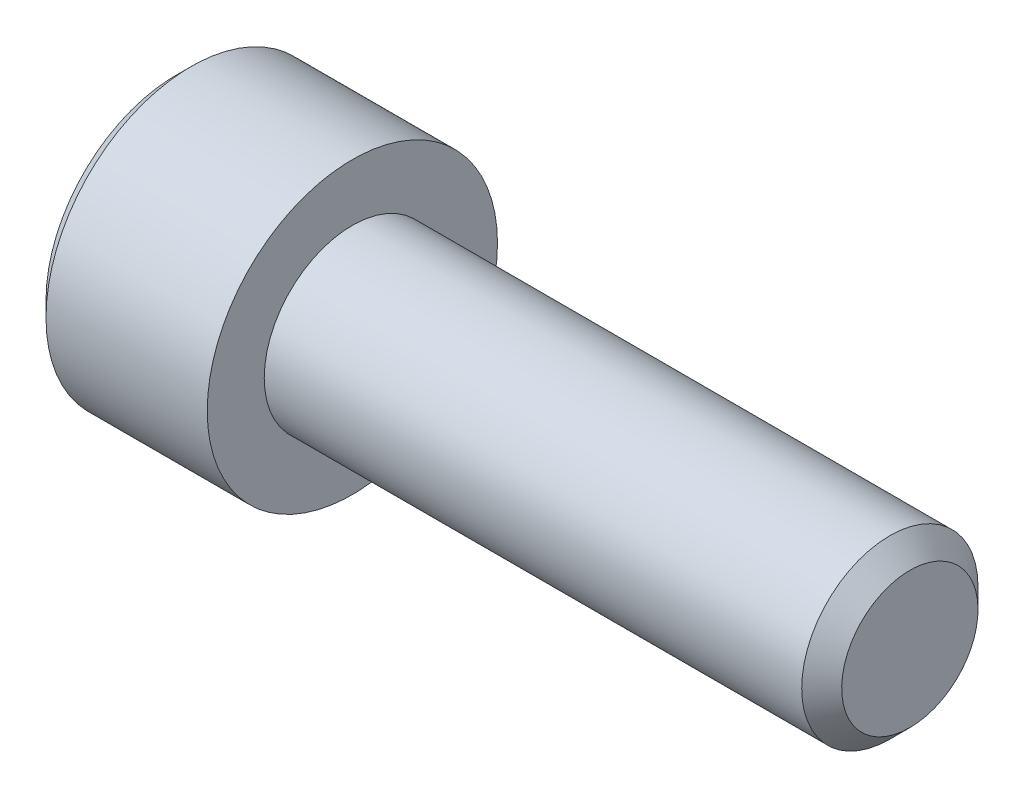
ISO-10303-21;
HEADER;
FILE_DESCRIPTION(('STEP AP214'),'2;1');
FILE_NAME('part.step','',(''),(''),'','','');
FILE_SCHEMA(('AUTOMOTIVE_DESIGN { 1 0 10303 214 1 1 1 1 }'));
ENDSEC;
DATA;
#1=APPLICATION_CONTEXT('core data for automotive mechanical design processes');
#2=APPLICATION_PROTOCOL_DEFINITION('international standard','automotive_design',2000,#1);
#3=PRODUCT_CONTEXT('',#1,'mechanical');
#4=PRODUCT('Part','Part','',(#3));
#5=PRODUCT_RELATED_PRODUCT_CATEGORY('part','',(#4));
#6=PRODUCT_DEFINITION_FORMATION('','',#4);
#7=PRODUCT_DEFINITION_CONTEXT('part definition',#1,'design');
#8=PRODUCT_DEFINITION('design','',#6,#7);
#9=PRODUCT_DEFINITION_SHAPE('','',#8);
#10=(LENGTH_UNIT() NAMED_UNIT(*) SI_UNIT(.MILLI.,.METRE.));
#11=(NAMED_UNIT(*) PLANE_ANGLE_UNIT() SI_UNIT($,.RADIAN.));
#12=(NAMED_UNIT(*) SI_UNIT($,.STERADIAN.) SOLID_ANGLE_UNIT());
#13=UNCERTAINTY_MEASURE_WITH_UNIT(LENGTH_MEASURE(1.E-05),#10,'distance_accuracy_value','');
#14=(GEOMETRIC_REPRESENTATION_CONTEXT(3) GLOBAL_UNCERTAINTY_ASSIGNED_CONTEXT((#13)) GLOBAL_UNIT_ASSIGNED_CONTEXT((#10,
#11,#12)) REPRESENTATION_CONTEXT('',''));
#15=CARTESIAN_POINT('',(0.,0.,0.));
#16=DIRECTION('',(0.,0.,1.));
#17=DIRECTION('',(1.,0.,0.));
#18=AXIS2_PLACEMENT_3D('',#15,#16,#17);
#19=CARTESIAN_POINT('',(-2.21694374982917,0.,0.));
#20=DIRECTION('',(-1.,0.,0.));
#21=DIRECTION('',(0.,0.,1.));
#22=AXIS2_PLACEMENT_3D('',#19,#20,#21);
#23=CONICAL_SURFACE('',#22,2.07459633060125,1.04719755102264);
#24=CARTESIAN_POINT('',(-1.01917499975457,0.,-2.27373675443232E-10));
#25=VERTEX_POINT('',#24);
#26=VERTEX_LOOP('',#25);
#27=FACE_BOUND('',#26,.T.);
#28=CARTESIAN_POINT('',(-2.2097999998902,1.09725896522129E-11,-2.06222299275537));
#29=CARTESIAN_POINT('',(-2.18363203744138,0.0784811371108861,-2.01691188712442));
#30=CARTESIAN_POINT('',(-2.15983364512322,0.157639722270298,-1.97120965667397));
#31=CARTESIAN_POINT('',(-2.11829426610016,0.317327470541627,-1.87901389222323));
#32=CARTESIAN_POINT('',(-2.10056797284901,0.397859470072181,-1.83251872061588));
#33=CARTESIAN_POINT('',(-2.07297571942376,0.557925476432116,-1.74010456875587));
#34=CARTESIAN_POINT('',(-2.06292609609855,0.637434861953671,-1.6941998036219));
#35=CARTESIAN_POINT('',(-2.05093118668194,0.796827555740842,-1.60217438895701));
#36=CARTESIAN_POINT('',(-2.04897596538542,0.876710285054878,-1.55605407368395));
#37=CARTESIAN_POINT('',(-2.05305388237055,1.02596259515888,-1.46988321226823));
#38=CARTESIAN_POINT('',(-2.05808575687008,1.09535457247395,-1.42981973548578));
#39=CARTESIAN_POINT('',(-2.07403062072086,1.23368646100672,-1.34995378240387));
#40=CARTESIAN_POINT('',(-2.0849490514755,1.30262589412846,-1.31015158213326));
#41=CARTESIAN_POINT('',(-2.11224301510014,1.44124275939744,-1.23012109765599));
#42=CARTESIAN_POINT('',(-2.12873419131745,1.51090265655993,-1.1899029372775));
#43=CARTESIAN_POINT('',(-2.1661621894439,1.64918377401521,-1.11006629689085));
#44=CARTESIAN_POINT('',(-2.18709022290799,1.71780676448237,-1.07044679487204));
#45=CARTESIAN_POINT('',(-2.20979999989728,1.78593750001027,-1.03111149637492));
#46=B_SPLINE_CURVE_WITH_KNOTS('',3,(#28,#29,#30,#31,#32,#33,#34,#35,#36,#37,#38,#39,#40,#41,#42,
#43,#44,#45),.UNSPECIFIED.,.F.,.F.,(4,2,2,2,2,2,2,2,4),(0.,0.283085391587975,0.566851041335249,
0.84359437023131,1.11999791881968,1.36062343407243,1.60147176059153,1.8476609488634,
2.09336697168605),.UNSPECIFIED.);
#47=CARTESIAN_POINT('',(-2.20979999988995,-4.62298986547413E-12,-2.0622229927381));
#48=VERTEX_POINT('',#47);
#49=CARTESIAN_POINT('',(-2.20979999989872,1.78593750000579,-1.03111149638766));
#50=VERTEX_POINT('',#49);
#51=EDGE_CURVE('E171',#48,#50,#46,.T.);
#52=ORIENTED_EDGE('',*,*,#51,.F.);
#53=CARTESIAN_POINT('',(-2.20979999990519,-1.78593750000782,-1.03111149636406));
#54=CARTESIAN_POINT('',(-2.18363203745135,-1.70745636291131,-1.0764226020009));
#55=CARTESIAN_POINT('',(-2.1598336451306,-1.62829777775272,-1.12212483245411));
#56=CARTESIAN_POINT('',(-2.11829426610459,-1.46861002948081,-1.21432059690755));
#57=CARTESIAN_POINT('',(-2.10056797285306,-1.38807802994883,-1.26081576851484));
#58=CARTESIAN_POINT('',(-2.07297571942659,-1.22801202358675,-1.35322992037548));
#59=CARTESIAN_POINT('',(-2.06292609610054,-1.14850263806446,-1.3991346855101));
#60=CARTESIAN_POINT('',(-2.05093118668254,-0.989109944275587,-1.49116010017613));
#61=CARTESIAN_POINT('',(-2.04897596538548,-0.909227214960583,-1.53728041544968));
#62=CARTESIAN_POINT('',(-2.05305388236971,-0.759974904856102,-1.62345127686564));
#63=CARTESIAN_POINT('',(-2.05808575686875,-0.690582927541512,-1.66351475364783));
#64=CARTESIAN_POINT('',(-2.07403062071851,-0.55225103900968,-1.74338070672921));
#65=CARTESIAN_POINT('',(-2.08494905147262,-0.483311605888391,-1.78318290699956));
#66=CARTESIAN_POINT('',(-2.11224301509619,-0.344694740620254,-1.86321339147634));
#67=CARTESIAN_POINT('',(-2.12873419131297,-0.275034843458156,-1.9034315518546));
#68=CARTESIAN_POINT('',(-2.16616218943838,-0.136753726003615,-1.98326819224082));
#69=CARTESIAN_POINT('',(-2.18709022290197,-0.0681307355368011,-2.02288769425943));
#70=CARTESIAN_POINT('',(-2.20979999989077,-9.24720308734519E-12,-2.06222299275635));
#71=B_SPLINE_CURVE_WITH_KNOTS('',3,(#53,#54,#55,#56,#57,#58,#59,#60,#61,#62,#63,#64,#65,#66,#67,
#68,#69,#70),.UNSPECIFIED.,.F.,.F.,(4,2,2,2,2,2,2,2,4),(0.,0.283085391591813,0.566851041342766,
0.843594370242013,1.11999791883364,1.36062343408466,1.60147176060198,1.84766094887221,
2.0933669716933),.UNSPECIFIED.);
#72=CARTESIAN_POINT('',(-2.20979999989676,-1.78593750000737,-1.03111149637815));
#73=VERTEX_POINT('',#72);
#74=EDGE_CURVE('E21',#73,#48,#71,.T.);
#75=ORIENTED_EDGE('',*,*,#74,.F.);
#76=CARTESIAN_POINT('',(-2.20979999990561,-1.78593749998911,1.03111149639684));
#77=CARTESIAN_POINT('',(-2.18363203745164,-1.78593749999609,0.94048928513493));
#78=CARTESIAN_POINT('',(-2.15983364513082,-1.78593749999895,0.849084824233336));
#79=CARTESIAN_POINT('',(-2.11829426610471,-1.78593750000105,0.664693295329928));
#80=CARTESIAN_POINT('',(-2.10056797285318,-1.78593750000028,0.571702952113989));
#81=CARTESIAN_POINT('',(-2.07297571942667,-1.78593749999973,0.386874648391726));
#82=CARTESIAN_POINT('',(-2.0629260961006,-1.78593749999993,0.295065118122805));
#83=CARTESIAN_POINT('',(-2.05093118668256,-1.78593750000007,0.111014288790957));
#84=CARTESIAN_POINT('',(-2.04897596538548,-1.78593750000002,0.0187736582437296));
#85=CARTESIAN_POINT('',(-2.05305388236974,-1.78593749999998,-0.153568064590571));
#86=CARTESIAN_POINT('',(-2.058085756869,-1.7859375,-0.233695018157239));
#87=CARTESIAN_POINT('',(-2.07403062071954,-1.7859375,-0.393426924324539));
#88=CARTESIAN_POINT('',(-2.08494905147419,-1.7859375,-0.473031324867516));
#89=CARTESIAN_POINT('',(-2.11224301509914,-1.7859375,-0.633092293825662));
#90=CARTESIAN_POINT('',(-2.12873419131676,-1.7859375,-0.713528614584499));
#91=CARTESIAN_POINT('',(-2.16616218944403,-1.7859375,-0.873201895361495));
#92=CARTESIAN_POINT('',(-2.18709022290864,-1.7859375,-0.952440899400956));
#93=CARTESIAN_POINT('',(-2.20979999989852,-1.7859375,-1.031111496397));
#94=B_SPLINE_CURVE_WITH_KNOTS('',3,(#76,#77,#78,#79,#80,#81,#82,#83,#84,#85,#86,#87,#88,#89,#90,
#91,#92,#93),.UNSPECIFIED.,.F.,.F.,(4,2,2,2,2,2,2,2,4),(0.,0.283085391591947,0.566851041343033,
0.843594370242341,1.11999791883402,1.36062343409196,1.60147176061623,1.84766094889376,
2.09336697172211),.UNSPECIFIED.);
#95=CARTESIAN_POINT('',(-2.2097999998989,-1.78593750000737,1.03111149638554));
#96=VERTEX_POINT('',#95);
#97=EDGE_CURVE('E95',#96,#73,#94,.T.);
#98=ORIENTED_EDGE('',*,*,#97,.F.);
#99=CARTESIAN_POINT('',(-2.20979999991607,3.12057355636284E-11,2.06222299275177));
#100=CARTESIAN_POINT('',(-2.1836320374565,-0.0784811370760846,2.01691188713447));
#101=CARTESIAN_POINT('',(-2.15983364513316,-0.157639722239571,1.97120965668901));
#102=CARTESIAN_POINT('',(-2.11829426610485,-0.317327470516074,1.87901389224068));
#103=CARTESIAN_POINT('',(-2.10056797285361,-0.397859470047716,1.83251872063072));
#104=CARTESIAN_POINT('',(-2.07297571942713,-0.557925476410414,1.7401045687677));
#105=CARTESIAN_POINT('',(-2.06292609610077,-0.637434861933618,1.69419980363329));
#106=CARTESIAN_POINT('',(-2.05093118668249,-0.796827555723997,1.60217438896692));
#107=CARTESIAN_POINT('',(-2.04897596538545,-0.876710285039592,1.55605407369282));
#108=CARTESIAN_POINT('',(-2.05305388236982,-1.0259625951465,1.46988321227534));
#109=CARTESIAN_POINT('',(-2.05808575686909,-1.0953545724629,1.42981973549214));
#110=CARTESIAN_POINT('',(-2.07403062071961,-1.2336864609983,1.34995378240874));
#111=CARTESIAN_POINT('',(-2.08494905147424,-1.30262589412133,1.31015158213737));
#112=CARTESIAN_POINT('',(-2.11224301509913,-1.44124275939309,1.2301210976585));
#113=CARTESIAN_POINT('',(-2.12873419131671,-1.51090265655705,1.18990293727916));
#114=CARTESIAN_POINT('',(-2.16616218944389,-1.64918377401529,1.11006629689081));
#115=CARTESIAN_POINT('',(-2.18709022290845,-1.71780676448393,1.07044679487115));
#116=CARTESIAN_POINT('',(-2.20979999989828,-1.78593750001328,1.03111149637318));
#117=B_SPLINE_CURVE_WITH_KNOTS('',3,(#99,#100,#101,#102,#103,#104,#105,#106,#107,#108,#109,#110,
#111,#112,#113,#114,#115,#116),.UNSPECIFIED.,.F.,.F.,(4,2,2,2,2,2,2,2,4),(0.,0.28308539159484,
0.566851041348576,0.843594370250035,1.11999791884397,1.36062343410124,1.60147176062477,
1.84766094890181,2.09336697172975),.UNSPECIFIED.);
#118=CARTESIAN_POINT('',(-2.20979999989529,1.13804215653077E-11,2.06222299274735));
#119=VERTEX_POINT('',#118);
#120=EDGE_CURVE('E137',#119,#96,#117,.T.);
#121=ORIENTED_EDGE('',*,*,#120,.F.);
#122=CARTESIAN_POINT('',(-2.2097999999056,1.7859375000084,1.03111149636342));
#123=CARTESIAN_POINT('',(-2.18363203745163,1.70745636291196,1.07642260200042));
#124=CARTESIAN_POINT('',(-2.15983364513081,1.62829777775339,1.12212483245369));
#125=CARTESIAN_POINT('',(-2.11829426610471,1.46861002948143,1.21432059690722));
#126=CARTESIAN_POINT('',(-2.10056797285317,1.38807802994941,1.26081576851452));
#127=CARTESIAN_POINT('',(-2.07297571942667,1.22801202358727,1.35322992037517));
#128=CARTESIAN_POINT('',(-2.06292609610059,1.14850263806497,1.3991346855098));
#129=CARTESIAN_POINT('',(-2.05093118668256,0.989109944276064,1.49116010017585));
#130=CARTESIAN_POINT('',(-2.04897596538548,0.909227214961045,1.53728041544942));
#131=CARTESIAN_POINT('',(-2.05305388236974,0.759974904854406,1.62345127686662));
#132=CARTESIAN_POINT('',(-2.05808575686902,0.69058292753768,1.66351475365005));
#133=CARTESIAN_POINT('',(-2.07403062071961,0.55225103900161,1.74338070673387));
#134=CARTESIAN_POINT('',(-2.08494905147431,0.48331160587822,1.78318290700543));
#135=CARTESIAN_POINT('',(-2.11224301509936,0.34469474060583,1.86321339148466));
#136=CARTESIAN_POINT('',(-2.12873419131703,0.275034843441581,1.90343155186417));
#137=CARTESIAN_POINT('',(-2.16616218944444,0.136753725982819,1.98326819225283));
#138=CARTESIAN_POINT('',(-2.18709022290912,0.0681307355139321,2.02288769427264));
#139=CARTESIAN_POINT('',(-2.20979999989908,-1.56654331860135E-11,2.06222299277073));
#140=B_SPLINE_CURVE_WITH_KNOTS('',3,(#122,#123,#124,#125,#126,#127,#128,#129,#130,#131,#132,
#133,#134,#135,#136,#137,#138,#139),.UNSPECIFIED.,.F.,.F.,(4,2,2,2,2,2,2,2,4),(0.,
0.283085391591948,0.566851041343036,0.843594370242341,1.11999791883402,1.36062343409245,
1.60147176061721,1.84766094889526,2.09336697172412),.UNSPECIFIED.);
#141=CARTESIAN_POINT('',(-2.20979999989889,1.78593750000775,1.03111149638488));
#142=VERTEX_POINT('',#141);
#143=EDGE_CURVE('E159',#142,#119,#140,.T.);
#144=ORIENTED_EDGE('',*,*,#143,.F.);
#145=CARTESIAN_POINT('',(-2.20979999990673,1.78593749998839,-1.03111149639912));
#146=CARTESIAN_POINT('',(-2.18363203745242,1.78593749999583,-0.940489285137205));
#147=CARTESIAN_POINT('',(-2.15983364513141,1.78593749999888,-0.84908482423556));
#148=CARTESIAN_POINT('',(-2.11829426610509,1.78593750000112,-0.664693295332012));
#149=CARTESIAN_POINT('',(-2.10056797285351,1.7859375000003,-0.571702952115983));
#150=CARTESIAN_POINT('',(-2.07297571942691,1.78593749999971,-0.386874648393559));
#151=CARTESIAN_POINT('',(-2.06292609610076,1.78593749999992,-0.295065118124566));
#152=CARTESIAN_POINT('',(-2.05093118668262,1.78593750000008,-0.111014288792565));
#153=CARTESIAN_POINT('',(-2.04897596538549,1.78593750000002,-0.0187736582452566));
#154=CARTESIAN_POINT('',(-2.05305388236967,1.78593749999998,0.153568064589173));
#155=CARTESIAN_POINT('',(-2.0580857568689,1.7859375,0.233695018155889));
#156=CARTESIAN_POINT('',(-2.07403062071938,1.78593750000001,0.393426924323285));
#157=CARTESIAN_POINT('',(-2.08494905147402,1.7859375,0.47303132486631));
#158=CARTESIAN_POINT('',(-2.11224301509893,1.7859375,0.63309229382456));
#159=CARTESIAN_POINT('',(-2.12873419131654,1.7859375,0.713528614583453));
#160=CARTESIAN_POINT('',(-2.16616218944379,1.7859375,0.873201895360561));
#161=CARTESIAN_POINT('',(-2.1870902229084,1.7859375,0.952440899400077));
#162=CARTESIAN_POINT('',(-2.20979999989828,1.7859375,1.03111149639618));
#163=B_SPLINE_CURVE_WITH_KNOTS('',3,(#145,#146,#147,#148,#149,#150,#151,#152,#153,#154,#155,
#156,#157,#158,#159,#160,#161,#162),.UNSPECIFIED.,.F.,.F.,(4,2,2,2,2,2,2,2,4),(0.,
0.283085391592233,0.566851041343597,0.843594370243144,1.11999791883507,1.36062343409315,
1.60147176061755,1.84766094889524,2.09336697172374),.UNSPECIFIED.);
#164=EDGE_CURVE('E166',#50,#142,#163,.T.);
#165=ORIENTED_EDGE('',*,*,#164,.F.);
#166=EDGE_LOOP('',(#52,#75,#98,#121,#144,#165));
#167=FACE_BOUND('',#166,.T.);
#168=ADVANCED_FACE('F17',(#27,#167),#23,.F.);
#169=CARTESIAN_POINT('',(0.,0.,-2.06222299276169));
#170=DIRECTION('',(0.,0.5,0.866025403784439));
#171=DIRECTION('',(0.,-0.866025403784439,0.5));
#172=AXIS2_PLACEMENT_3D('',#169,#170,#171);
#173=PLANE('',#172);
#174=ORIENTED_EDGE('',*,*,#74,.T.);
#175=DIRECTION('',(1.,0.,0.));
#176=VECTOR('',#175,1.);
#177=CARTESIAN_POINT('',(0.,0.,-2.0622229927617));
#178=LINE('',#177,#176);
#179=CARTESIAN_POINT('',(-4.1656,-1.85466870176759E-12,-2.06222299276134));
#180=VERTEX_POINT('',#179);
#181=EDGE_CURVE('E84',#180,#48,#178,.T.);
#182=ORIENTED_EDGE('',*,*,#181,.F.);
#183=DIRECTION('',(0.,0.866025403784438,-0.500000000000001));
#184=VECTOR('',#183,1.);
#185=CARTESIAN_POINT('',(-4.1656,-1.7859375,-1.03111149638085));
#186=LINE('',#185,#184);
#187=CARTESIAN_POINT('',(-4.1656,-1.7859375,-1.03111149638397));
#188=VERTEX_POINT('',#187);
#189=EDGE_CURVE('E78',#188,#180,#186,.T.);
#190=ORIENTED_EDGE('',*,*,#189,.F.);
#191=DIRECTION('',(1.,0.,0.));
#192=VECTOR('',#191,1.);
#193=CARTESIAN_POINT('',(0.,-1.7859375,-1.03111149638397));
#194=LINE('',#193,#192);
#195=EDGE_CURVE('E81',#73,#188,#194,.F.);
#196=ORIENTED_EDGE('',*,*,#195,.F.);
#197=EDGE_LOOP('',(#174,#182,#190,#196));
#198=FACE_BOUND('',#197,.T.);
#199=ADVANCED_FACE('F80',(#198),#173,.T.);
#200=CARTESIAN_POINT('',(0.,1.7859375,-1.03111149638085));
#201=DIRECTION('',(0.,-0.500000000000001,0.866025403784438));
#202=DIRECTION('',(0.,-0.866025403784438,-0.500000000000001));
#203=AXIS2_PLACEMENT_3D('',#200,#201,#202);
#204=PLANE('',#203);
#205=ORIENTED_EDGE('',*,*,#51,.T.);
#206=DIRECTION('',(1.,0.,0.));
#207=VECTOR('',#206,1.);
#208=CARTESIAN_POINT('',(0.,1.7859375,-1.03111149638085));
#209=LINE('',#208,#207);
#210=CARTESIAN_POINT('',(-4.1656,1.7859375,-1.03111149638124));
#211=VERTEX_POINT('',#210);
#212=EDGE_CURVE('E170',#211,#50,#209,.T.);
#213=ORIENTED_EDGE('',*,*,#212,.F.);
#214=DIRECTION('',(0.,0.866025403784438,0.500000000000001));
#215=VECTOR('',#214,1.);
#216=CARTESIAN_POINT('',(-4.1656,0.,-2.0622229927617));
#217=LINE('',#216,#215);
#218=EDGE_CURVE('E89',#180,#211,#217,.T.);
#219=ORIENTED_EDGE('',*,*,#218,.F.);
#220=ORIENTED_EDGE('',*,*,#181,.T.);
#221=EDGE_LOOP('',(#205,#213,#219,#220));
#222=FACE_BOUND('',#221,.T.);
#223=ADVANCED_FACE('F175',(#222),#204,.T.);
#224=CARTESIAN_POINT('',(0.,1.7859375,1.03111149638085));
#225=DIRECTION('',(0.,-1.,0.));
#226=DIRECTION('',(1.,0.,0.));
#227=AXIS2_PLACEMENT_3D('',#224,#225,#226);
#228=PLANE('',#227);
#229=ORIENTED_EDGE('',*,*,#164,.T.);
#230=DIRECTION('',(1.,0.,0.));
#231=VECTOR('',#230,1.);
#232=CARTESIAN_POINT('',(0.,1.7859375,1.03111149638084));
#233=LINE('',#232,#231);
#234=CARTESIAN_POINT('',(-4.1656,1.78593749999966,1.03111149638104));
#235=VERTEX_POINT('',#234);
#236=EDGE_CURVE('E165',#235,#142,#233,.T.);
#237=ORIENTED_EDGE('',*,*,#236,.F.);
#238=DIRECTION('',(0.,0.,1.));
#239=VECTOR('',#238,1.);
#240=CARTESIAN_POINT('',(-4.1656,1.7859375,1.5367));
#241=LINE('',#240,#239);
#242=EDGE_CURVE('E116',#211,#235,#241,.T.);
#243=ORIENTED_EDGE('',*,*,#242,.F.);
#244=ORIENTED_EDGE('',*,*,#212,.T.);
#245=EDGE_LOOP('',(#229,#237,#243,#244));
#246=FACE_BOUND('',#245,.T.);
#247=ADVANCED_FACE('F155',(#246),#228,.T.);
#248=CARTESIAN_POINT('',(0.,0.,2.06222299276169));
#249=DIRECTION('',(0.,-0.5,-0.866025403784439));
#250=DIRECTION('',(0.,0.866025403784439,-0.5));
#251=AXIS2_PLACEMENT_3D('',#248,#249,#250);
#252=PLANE('',#251);
#253=ORIENTED_EDGE('',*,*,#143,.T.);
#254=DIRECTION('',(1.,0.,0.));
#255=VECTOR('',#254,1.);
#256=CARTESIAN_POINT('',(0.,0.,2.0622229927617));
#257=LINE('',#256,#255);
#258=CARTESIAN_POINT('',(-4.1656,-2.1496867881859E-12,2.06222299276045));
#259=VERTEX_POINT('',#258);
#260=EDGE_CURVE('E164',#259,#119,#257,.T.);
#261=ORIENTED_EDGE('',*,*,#260,.F.);
#262=DIRECTION('',(0.,-0.866025403784439,0.499999999999999));
#263=VECTOR('',#262,1.);
#264=CARTESIAN_POINT('',(-4.1656,1.7859375,1.03111149638085));
#265=LINE('',#264,#263);
#266=EDGE_CURVE('E106',#235,#259,#265,.T.);
#267=ORIENTED_EDGE('',*,*,#266,.F.);
#268=ORIENTED_EDGE('',*,*,#236,.T.);
#269=EDGE_LOOP('',(#253,#261,#267,#268));
#270=FACE_BOUND('',#269,.T.);
#271=ADVANCED_FACE('F151',(#270),#252,.T.);
#272=CARTESIAN_POINT('',(0.,-1.7859375,1.03111149638085));
#273=DIRECTION('',(0.,0.5,-0.866025403784439));
#274=DIRECTION('',(0.,0.866025403784439,0.5));
#275=AXIS2_PLACEMENT_3D('',#272,#273,#274);
#276=PLANE('',#275);
#277=ORIENTED_EDGE('',*,*,#120,.T.);
#278=DIRECTION('',(1.,0.,0.));
#279=VECTOR('',#278,1.);
#280=CARTESIAN_POINT('',(0.,-1.7859375,1.03111149638085));
#281=LINE('',#280,#279);
#282=CARTESIAN_POINT('',(-4.1656,-1.7859375,1.03111149638046));
#283=VERTEX_POINT('',#282);
#284=EDGE_CURVE('E39',#283,#96,#281,.T.);
#285=ORIENTED_EDGE('',*,*,#284,.F.);
#286=DIRECTION('',(0.,-0.866025403784439,-0.499999999999998));
#287=VECTOR('',#286,1.);
#288=CARTESIAN_POINT('',(-4.1656,0.,2.06222299276169));
#289=LINE('',#288,#287);
#290=EDGE_CURVE('E100',#259,#283,#289,.T.);
#291=ORIENTED_EDGE('',*,*,#290,.F.);
#292=ORIENTED_EDGE('',*,*,#260,.T.);
#293=EDGE_LOOP('',(#277,#285,#291,#292));
#294=FACE_BOUND('',#293,.T.);
#295=ADVANCED_FACE('F146',(#294),#276,.T.);
#296=CARTESIAN_POINT('',(0.,-1.7859375,-1.03111149638085));
#297=DIRECTION('',(0.,1.,0.));
#298=DIRECTION('',(0.,0.,1.));
#299=AXIS2_PLACEMENT_3D('',#296,#297,#298);
#300=PLANE('',#299);
#301=ORIENTED_EDGE('',*,*,#97,.T.);
#302=ORIENTED_EDGE('',*,*,#195,.T.);
#303=DIRECTION('',(0.,0.,1.));
#304=VECTOR('',#303,1.);
#305=CARTESIAN_POINT('',(-4.1656,-1.7859375,1.5367));
#306=LINE('',#305,#304);
#307=EDGE_CURVE('E93',#283,#188,#306,.F.);
#308=ORIENTED_EDGE('',*,*,#307,.F.);
#309=ORIENTED_EDGE('',*,*,#284,.T.);
#310=EDGE_LOOP('',(#301,#302,#308,#309));
#311=FACE_BOUND('',#310,.T.);
#312=ADVANCED_FACE('F92',(#311),#300,.T.);
#313=CARTESIAN_POINT('',(-4.1656,0.,1.5367));
#314=DIRECTION('',(-1.,0.,0.));
#315=DIRECTION('',(0.,0.,1.));
#316=AXIS2_PLACEMENT_3D('',#313,#314,#315);
#317=PLANE('',#316);
#318=ORIENTED_EDGE('',*,*,#290,.T.);
#319=ORIENTED_EDGE('',*,*,#307,.T.);
#320=ORIENTED_EDGE('',*,*,#189,.T.);
#321=ORIENTED_EDGE('',*,*,#218,.T.);
#322=ORIENTED_EDGE('',*,*,#242,.T.);
#323=ORIENTED_EDGE('',*,*,#266,.T.);
#324=EDGE_LOOP('',(#318,#319,#320,#321,#322,#323));
#325=FACE_BOUND('',#324,.T.);
#326=CARTESIAN_POINT('',(-4.16560000002164,0.,0.));
#327=DIRECTION('',(1.,0.,0.));
#328=DIRECTION('',(0.,0.,-1.));
#329=AXIS2_PLACEMENT_3D('',#326,#327,#328);
#330=CIRCLE('',#329,3.07340000006206);
#331=CARTESIAN_POINT('',(-4.16560000002164,0.,-3.07340000006207));
#332=VERTEX_POINT('',#331);
#333=EDGE_CURVE('E101',#332,#332,#330,.T.);
#334=ORIENTED_EDGE('',*,*,#333,.F.);
#335=EDGE_LOOP('',(#334));
#336=FACE_BOUND('',#335,.T.);
#337=ADVANCED_FACE('F97',(#325,#336),#317,.T.);
#338=CARTESIAN_POINT('',(-3.81000000004406,0.,0.));
#339=DIRECTION('',(1.,0.,0.));
#340=DIRECTION('',(0.,0.,-1.));
#341=AXIS2_PLACEMENT_3D('',#338,#339,#340);
#342=CONICAL_SURFACE('',#341,3.42900000009649,0.785398163477374);
#343=ORIENTED_EDGE('',*,*,#333,.T.);
#344=EDGE_LOOP('',(#343));
#345=FACE_BOUND('',#344,.T.);
#346=CARTESIAN_POINT('',(-3.81000000010548,0.,0.));
#347=DIRECTION('',(-1.,0.,0.));
#348=DIRECTION('',(0.,0.,1.));
#349=AXIS2_PLACEMENT_3D('',#346,#347,#348);
#350=CIRCLE('',#349,3.429);
#351=CARTESIAN_POINT('',(-3.81000000010548,0.,3.429));
#352=VERTEX_POINT('',#351);
#353=EDGE_CURVE('E104',#352,#352,#350,.F.);
#354=ORIENTED_EDGE('',*,*,#353,.F.);
#355=EDGE_LOOP('',(#354));
#356=FACE_BOUND('',#355,.T.);
#357=ADVANCED_FACE('F208',(#345,#356),#342,.T.);
#358=CARTESIAN_POINT('',(13.17244,0.,0.));
#359=DIRECTION('',(1.,0.,0.));
#360=DIRECTION('',(0.,0.,-1.));
#361=AXIS2_PLACEMENT_3D('',#358,#359,#360);
#362=PLANE('',#361);
#363=CARTESIAN_POINT('',(13.1724400000053,0.,0.));
#364=DIRECTION('',(-1.,0.,0.));
#365=DIRECTION('',(0.,-1.,0.));
#366=AXIS2_PLACEMENT_3D('',#363,#364,#365);
#367=CIRCLE('',#366,1.61036000002923);
#368=CARTESIAN_POINT('',(13.1724400000053,-1.61036000002923,0.));
#369=VERTEX_POINT('',#368);
#370=EDGE_CURVE('E129',#369,#369,#367,.T.);
#371=ORIENTED_EDGE('',*,*,#370,.F.);
#372=EDGE_LOOP('',(#371));
#373=FACE_BOUND('',#372,.T.);
#374=ADVANCED_FACE('F205',(#373),#362,.T.);
#375=CARTESIAN_POINT('',(-1.905,0.,0.));
#376=DIRECTION('',(-1.,0.,0.));
#377=DIRECTION('',(0.,0.,1.));
#378=AXIS2_PLACEMENT_3D('',#375,#376,#377);
#379=CYLINDRICAL_SURFACE('',#378,3.429);
#380=CARTESIAN_POINT('',(0.,0.,0.));
#381=DIRECTION('',(-1.,0.,0.));
#382=DIRECTION('',(0.,0.,1.));
#383=AXIS2_PLACEMENT_3D('',#380,#381,#382);
#384=CIRCLE('',#383,3.429);
#385=CARTESIAN_POINT('',(0.,0.,3.429));
#386=VERTEX_POINT('',#385);
#387=EDGE_CURVE('E126',#386,#386,#384,.F.);
#388=ORIENTED_EDGE('',*,*,#387,.F.);
#389=EDGE_LOOP('',(#388));
#390=FACE_BOUND('',#389,.T.);
#391=ORIENTED_EDGE('',*,*,#353,.T.);
#392=EDGE_LOOP('',(#391));
#393=FACE_BOUND('',#392,.T.);
#394=ADVANCED_FACE('F201',(#390,#393),#379,.T.);
#395=CARTESIAN_POINT('',(12.700000000109,0.,0.));
#396=DIRECTION('',(-1.,0.,0.));
#397=DIRECTION('',(0.,-1.,0.));
#398=AXIS2_PLACEMENT_3D('',#395,#396,#397);
#399=CONICAL_SURFACE('',#398,2.08279999992556,0.785398163397448);
#400=ORIENTED_EDGE('',*,*,#370,.T.);
#401=EDGE_LOOP('',(#400));
#402=FACE_BOUND('',#401,.T.);
#403=CARTESIAN_POINT('',(12.7,0.,0.));
#404=DIRECTION('',(-1.,0.,0.));
#405=DIRECTION('',(0.,0.,1.));
#406=AXIS2_PLACEMENT_3D('',#403,#404,#405);
#407=CIRCLE('',#406,2.0828);
#408=CARTESIAN_POINT('',(12.7,0.,2.0828));
#409=VERTEX_POINT('',#408);
#410=EDGE_CURVE('E30',#409,#409,#407,.T.);
#411=ORIENTED_EDGE('',*,*,#410,.F.);
#412=EDGE_LOOP('',(#411));
#413=FACE_BOUND('',#412,.T.);
#414=ADVANCED_FACE('F194',(#402,#413),#399,.T.);
#415=CARTESIAN_POINT('',(0.,0.,1.7145));
#416=DIRECTION('',(1.,0.,0.));
#417=DIRECTION('',(0.,0.,-1.));
#418=AXIS2_PLACEMENT_3D('',#415,#416,#417);
#419=PLANE('',#418);
#420=CARTESIAN_POINT('',(0.,0.,0.));
#421=DIRECTION('',(-1.,0.,0.));
#422=DIRECTION('',(0.,0.,1.));
#423=AXIS2_PLACEMENT_3D('',#420,#421,#422);
#424=CIRCLE('',#423,2.0828);
#425=CARTESIAN_POINT('',(0.,0.,2.0828));
#426=VERTEX_POINT('',#425);
#427=EDGE_CURVE('E11',#426,#426,#424,.F.);
#428=ORIENTED_EDGE('',*,*,#427,.F.);
#429=EDGE_LOOP('',(#428));
#430=FACE_BOUND('',#429,.T.);
#431=ORIENTED_EDGE('',*,*,#387,.T.);
#432=EDGE_LOOP('',(#431));
#433=FACE_BOUND('',#432,.T.);
#434=ADVANCED_FACE('F188',(#430,#433),#419,.T.);
#435=CARTESIAN_POINT('',(12.7,0.,0.));
#436=DIRECTION('',(-1.,0.,0.));
#437=DIRECTION('',(0.,0.,1.));
#438=AXIS2_PLACEMENT_3D('',#435,#436,#437);
#439=CYLINDRICAL_SURFACE('',#438,2.0828);
#440=ORIENTED_EDGE('',*,*,#427,.T.);
#441=EDGE_LOOP('',(#440));
#442=FACE_BOUND('',#441,.T.);
#443=ORIENTED_EDGE('',*,*,#410,.T.);
#444=EDGE_LOOP('',(#443));
#445=FACE_BOUND('',#444,.T.);
#446=ADVANCED_FACE('F186',(#442,#445),#439,.T.);
#447=CLOSED_SHELL('',(#168,#199,#223,#247,#271,#295,#312,#337,#357,#374,#394,#414,#434,#446));
#448=MANIFOLD_SOLID_BREP('B1',#447);
#449=ADVANCED_BREP_SHAPE_REPRESENTATION('',(#18,#448),#14);
#450=SHAPE_DEFINITION_REPRESENTATION(#9,#449);
ENDSEC;
END-ISO-10303-21;
